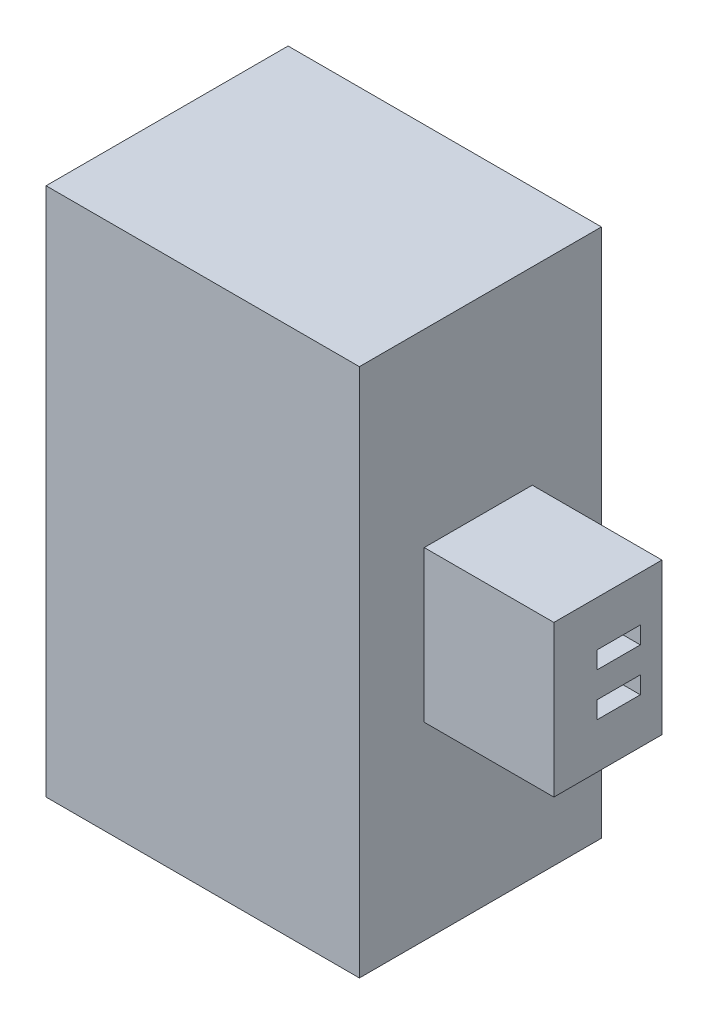
ISO-10303-21;
HEADER;
FILE_DESCRIPTION(('STEP AP214'),'2;1');
FILE_NAME('part.step','',(''),(''),'','','');
FILE_SCHEMA(('AUTOMOTIVE_DESIGN { 1 0 10303 214 1 1 1 1 }'));
ENDSEC;
DATA;
#1=APPLICATION_CONTEXT('core data for automotive mechanical design processes');
#2=APPLICATION_PROTOCOL_DEFINITION('international standard','automotive_design',2000,#1);
#3=PRODUCT_CONTEXT('',#1,'mechanical');
#4=PRODUCT('Part','Part','',(#3));
#5=PRODUCT_RELATED_PRODUCT_CATEGORY('part','',(#4));
#6=PRODUCT_DEFINITION_FORMATION('','',#4);
#7=PRODUCT_DEFINITION_CONTEXT('part definition',#1,'design');
#8=PRODUCT_DEFINITION('design','',#6,#7);
#9=PRODUCT_DEFINITION_SHAPE('','',#8);
#10=(LENGTH_UNIT() NAMED_UNIT(*) SI_UNIT(.MILLI.,.METRE.));
#11=(NAMED_UNIT(*) PLANE_ANGLE_UNIT() SI_UNIT($,.RADIAN.));
#12=(NAMED_UNIT(*) SI_UNIT($,.STERADIAN.) SOLID_ANGLE_UNIT());
#13=UNCERTAINTY_MEASURE_WITH_UNIT(LENGTH_MEASURE(1.E-05),#10,'distance_accuracy_value','');
#14=(GEOMETRIC_REPRESENTATION_CONTEXT(3) GLOBAL_UNCERTAINTY_ASSIGNED_CONTEXT((#13)) GLOBAL_UNIT_ASSIGNED_CONTEXT((#10,
#11,#12)) REPRESENTATION_CONTEXT('',''));
#15=CARTESIAN_POINT('',(0.,0.,0.));
#16=DIRECTION('',(0.,0.,1.));
#17=DIRECTION('',(1.,0.,0.));
#18=AXIS2_PLACEMENT_3D('',#15,#16,#17);
#19=CARTESIAN_POINT('',(0.,0.,5.6));
#20=DIRECTION('',(1.,0.,0.));
#21=DIRECTION('',(0.,0.,-1.));
#22=AXIS2_PLACEMENT_3D('',#19,#20,#21);
#23=PLANE('',#22);
#24=DIRECTION('',(0.,1.,0.));
#25=VECTOR('',#24,1.);
#26=CARTESIAN_POINT('',(0.,-1.62170824512628,4.85));
#27=LINE('',#26,#25);
#28=CARTESIAN_POINT('',(0.,0.750000000000001,4.85));
#29=VERTEX_POINT('',#28);
#30=CARTESIAN_POINT('',(0.,11.5,4.85));
#31=VERTEX_POINT('',#30);
#32=EDGE_CURVE('E171',#29,#31,#27,.T.);
#33=ORIENTED_EDGE('',*,*,#32,.T.);
#34=DIRECTION('',(0.,0.,1.));
#35=VECTOR('',#34,1.);
#36=CARTESIAN_POINT('',(0.,11.5,5.6));
#37=LINE('',#36,#35);
#38=CARTESIAN_POINT('',(0.,11.5,0.));
#39=VERTEX_POINT('',#38);
#40=EDGE_CURVE('E196',#39,#31,#37,.T.);
#41=ORIENTED_EDGE('',*,*,#40,.F.);
#42=DIRECTION('',(0.,-1.,0.));
#43=VECTOR('',#42,1.);
#44=CARTESIAN_POINT('',(0.,0.,0.));
#45=LINE('',#44,#43);
#46=CARTESIAN_POINT('',(0.,0.750000000000001,0.));
#47=VERTEX_POINT('',#46);
#48=EDGE_CURVE('E184',#39,#47,#45,.T.);
#49=ORIENTED_EDGE('',*,*,#48,.T.);
#50=DIRECTION('',(0.,0.,-1.));
#51=VECTOR('',#50,1.);
#52=CARTESIAN_POINT('',(0.,0.750000000000001,5.6));
#53=LINE('',#52,#51);
#54=EDGE_CURVE('E56',#29,#47,#53,.T.);
#55=ORIENTED_EDGE('',*,*,#54,.F.);
#56=EDGE_LOOP('',(#33,#41,#49,#55));
#57=FACE_BOUND('',#56,.T.);
#58=ADVANCED_FACE('F32',(#57),#23,.F.);
#59=CARTESIAN_POINT('',(-2.25,11.5,5.6));
#60=DIRECTION('',(0.,1.,0.));
#61=DIRECTION('',(0.,0.,1.));
#62=AXIS2_PLACEMENT_3D('',#59,#60,#61);
#63=PLANE('',#62);
#64=DIRECTION('',(1.,0.,0.));
#65=VECTOR('',#64,1.);
#66=CARTESIAN_POINT('',(-2.25,11.5,4.85));
#67=LINE('',#66,#65);
#68=CARTESIAN_POINT('',(-2.25,11.5,4.85));
#69=VERTEX_POINT('',#68);
#70=EDGE_CURVE('E176',#69,#31,#67,.T.);
#71=ORIENTED_EDGE('',*,*,#70,.F.);
#72=DIRECTION('',(0.,0.,1.));
#73=VECTOR('',#72,1.);
#74=CARTESIAN_POINT('',(-2.25,11.5,5.6));
#75=LINE('',#74,#73);
#76=CARTESIAN_POINT('',(-2.25,11.5,0.));
#77=VERTEX_POINT('',#76);
#78=EDGE_CURVE('E205',#77,#69,#75,.T.);
#79=ORIENTED_EDGE('',*,*,#78,.F.);
#80=DIRECTION('',(1.,0.,0.));
#81=VECTOR('',#80,1.);
#82=CARTESIAN_POINT('',(-2.25,11.5,0.));
#83=LINE('',#82,#81);
#84=EDGE_CURVE('E207',#77,#39,#83,.T.);
#85=ORIENTED_EDGE('',*,*,#84,.T.);
#86=ORIENTED_EDGE('',*,*,#40,.T.);
#87=EDGE_LOOP('',(#71,#79,#85,#86));
#88=FACE_BOUND('',#87,.T.);
#89=ADVANCED_FACE('F377',(#88),#63,.F.);
#90=CARTESIAN_POINT('',(-2.25,0.750000000000001,5.6));
#91=DIRECTION('',(0.,-1.,0.));
#92=DIRECTION('',(0.,0.,-1.));
#93=AXIS2_PLACEMENT_3D('',#90,#91,#92);
#94=PLANE('',#93);
#95=DIRECTION('',(1.,0.,0.));
#96=VECTOR('',#95,1.);
#97=CARTESIAN_POINT('',(-2.25,0.750000000000001,4.85));
#98=LINE('',#97,#96);
#99=CARTESIAN_POINT('',(-2.25,0.750000000000001,4.85));
#100=VERTEX_POINT('',#99);
#101=EDGE_CURVE('E173',#100,#29,#98,.T.);
#102=ORIENTED_EDGE('',*,*,#101,.T.);
#103=ORIENTED_EDGE('',*,*,#54,.T.);
#104=DIRECTION('',(1.,0.,0.));
#105=VECTOR('',#104,1.);
#106=CARTESIAN_POINT('',(-2.25,0.750000000000001,0.));
#107=LINE('',#106,#105);
#108=CARTESIAN_POINT('',(-2.25,0.750000000000001,0.));
#109=VERTEX_POINT('',#108);
#110=EDGE_CURVE('E194',#109,#47,#107,.T.);
#111=ORIENTED_EDGE('',*,*,#110,.F.);
#112=DIRECTION('',(0.,0.,-1.));
#113=VECTOR('',#112,1.);
#114=CARTESIAN_POINT('',(-2.25,0.750000000000001,5.6));
#115=LINE('',#114,#113);
#116=EDGE_CURVE('E181',#100,#109,#115,.T.);
#117=ORIENTED_EDGE('',*,*,#116,.F.);
#118=EDGE_LOOP('',(#102,#103,#111,#117));
#119=FACE_BOUND('',#118,.T.);
#120=ADVANCED_FACE('F180',(#119),#94,.F.);
#121=CARTESIAN_POINT('',(5.,0.,5.6));
#122=DIRECTION('',(-1.,0.,0.));
#123=DIRECTION('',(0.,0.,1.));
#124=AXIS2_PLACEMENT_3D('',#121,#122,#123);
#125=PLANE('',#124);
#126=DIRECTION('',(0.,1.,0.));
#127=VECTOR('',#126,1.);
#128=CARTESIAN_POINT('',(5.,0.,0.));
#129=LINE('',#128,#127);
#130=CARTESIAN_POINT('',(5.,0.,0.));
#131=VERTEX_POINT('',#130);
#132=CARTESIAN_POINT('',(5.,12.25,0.));
#133=VERTEX_POINT('',#132);
#134=EDGE_CURVE('E319',#131,#133,#129,.T.);
#135=ORIENTED_EDGE('',*,*,#134,.T.);
#136=DIRECTION('',(0.,0.,-1.));
#137=VECTOR('',#136,1.);
#138=CARTESIAN_POINT('',(5.,12.25,5.6));
#139=LINE('',#138,#137);
#140=CARTESIAN_POINT('',(5.,12.25,5.6));
#141=VERTEX_POINT('',#140);
#142=EDGE_CURVE('E40',#141,#133,#139,.T.);
#143=ORIENTED_EDGE('',*,*,#142,.F.);
#144=DIRECTION('',(0.,1.,0.));
#145=VECTOR('',#144,1.);
#146=CARTESIAN_POINT('',(5.,0.,5.6));
#147=LINE('',#146,#145);
#148=CARTESIAN_POINT('',(5.,0.,5.6));
#149=VERTEX_POINT('',#148);
#150=EDGE_CURVE('E311',#149,#141,#147,.T.);
#151=ORIENTED_EDGE('',*,*,#150,.F.);
#152=DIRECTION('',(0.,0.,-1.));
#153=VECTOR('',#152,1.);
#154=CARTESIAN_POINT('',(5.,0.,5.6));
#155=LINE('',#154,#153);
#156=EDGE_CURVE('E11',#149,#131,#155,.T.);
#157=ORIENTED_EDGE('',*,*,#156,.T.);
#158=EDGE_LOOP('',(#135,#143,#151,#157));
#159=FACE_BOUND('',#158,.T.);
#160=DIRECTION('',(0.,-1.,0.));
#161=VECTOR('',#160,1.);
#162=CARTESIAN_POINT('',(5.,7.875,4.1));
#163=LINE('',#162,#161);
#164=CARTESIAN_POINT('',(5.,7.875,4.1));
#165=VERTEX_POINT('',#164);
#166=CARTESIAN_POINT('',(5.,4.375,4.1));
#167=VERTEX_POINT('',#166);
#168=EDGE_CURVE('E276',#165,#167,#163,.T.);
#169=ORIENTED_EDGE('',*,*,#168,.F.);
#170=DIRECTION('',(0.,0.,1.));
#171=VECTOR('',#170,1.);
#172=CARTESIAN_POINT('',(5.,7.875,4.1));
#173=LINE('',#172,#171);
#174=CARTESIAN_POINT('',(5.,7.875,1.6));
#175=VERTEX_POINT('',#174);
#176=EDGE_CURVE('E281',#175,#165,#173,.T.);
#177=ORIENTED_EDGE('',*,*,#176,.F.);
#178=DIRECTION('',(0.,1.,0.));
#179=VECTOR('',#178,1.);
#180=CARTESIAN_POINT('',(5.,7.875,1.6));
#181=LINE('',#180,#179);
#182=CARTESIAN_POINT('',(5.,4.375,1.6));
#183=VERTEX_POINT('',#182);
#184=EDGE_CURVE('E293',#183,#175,#181,.T.);
#185=ORIENTED_EDGE('',*,*,#184,.F.);
#186=DIRECTION('',(0.,0.,-1.));
#187=VECTOR('',#186,1.);
#188=CARTESIAN_POINT('',(5.,4.375,4.1));
#189=LINE('',#188,#187);
#190=EDGE_CURVE('E290',#167,#183,#189,.T.);
#191=ORIENTED_EDGE('',*,*,#190,.F.);
#192=EDGE_LOOP('',(#169,#177,#185,#191));
#193=FACE_BOUND('',#192,.T.);
#194=ADVANCED_FACE('F344',(#159,#193),#125,.F.);
#195=CARTESIAN_POINT('',(0.,0.,5.6));
#196=DIRECTION('',(0.,1.,0.));
#197=DIRECTION('',(0.,0.,1.));
#198=AXIS2_PLACEMENT_3D('',#195,#196,#197);
#199=PLANE('',#198);
#200=DIRECTION('',(1.,0.,0.));
#201=VECTOR('',#200,1.);
#202=CARTESIAN_POINT('',(0.,0.,0.));
#203=LINE('',#202,#201);
#204=CARTESIAN_POINT('',(-2.25,0.,0.));
#205=VERTEX_POINT('',#204);
#206=EDGE_CURVE('E317',#205,#131,#203,.T.);
#207=ORIENTED_EDGE('',*,*,#206,.T.);
#208=ORIENTED_EDGE('',*,*,#156,.F.);
#209=DIRECTION('',(1.,0.,0.));
#210=VECTOR('',#209,1.);
#211=CARTESIAN_POINT('',(0.,0.,5.6));
#212=LINE('',#211,#210);
#213=CARTESIAN_POINT('',(-2.25,0.,5.6));
#214=VERTEX_POINT('',#213);
#215=EDGE_CURVE('E309',#214,#149,#212,.T.);
#216=ORIENTED_EDGE('',*,*,#215,.F.);
#217=DIRECTION('',(0.,0.,1.));
#218=VECTOR('',#217,1.);
#219=CARTESIAN_POINT('',(-2.25,0.,5.6));
#220=LINE('',#219,#218);
#221=EDGE_CURVE('E186',#205,#214,#220,.T.);
#222=ORIENTED_EDGE('',*,*,#221,.F.);
#223=EDGE_LOOP('',(#207,#208,#216,#222));
#224=FACE_BOUND('',#223,.T.);
#225=ADVANCED_FACE('F343',(#224),#199,.F.);
#226=CARTESIAN_POINT('',(0.,12.25,5.6));
#227=DIRECTION('',(0.,-1.,0.));
#228=DIRECTION('',(0.,0.,-1.));
#229=AXIS2_PLACEMENT_3D('',#226,#227,#228);
#230=PLANE('',#229);
#231=DIRECTION('',(-1.,0.,0.));
#232=VECTOR('',#231,1.);
#233=CARTESIAN_POINT('',(0.,12.25,0.));
#234=LINE('',#233,#232);
#235=CARTESIAN_POINT('',(-2.25,12.25,0.));
#236=VERTEX_POINT('',#235);
#237=EDGE_CURVE('E312',#133,#236,#234,.T.);
#238=ORIENTED_EDGE('',*,*,#237,.T.);
#239=DIRECTION('',(0.,0.,-1.));
#240=VECTOR('',#239,1.);
#241=CARTESIAN_POINT('',(-2.25,12.25,5.6));
#242=LINE('',#241,#240);
#243=CARTESIAN_POINT('',(-2.25,12.25,5.6));
#244=VERTEX_POINT('',#243);
#245=EDGE_CURVE('E200',#244,#236,#242,.T.);
#246=ORIENTED_EDGE('',*,*,#245,.F.);
#247=DIRECTION('',(-1.,0.,0.));
#248=VECTOR('',#247,1.);
#249=CARTESIAN_POINT('',(0.,12.25,5.6));
#250=LINE('',#249,#248);
#251=EDGE_CURVE('E314',#141,#244,#250,.T.);
#252=ORIENTED_EDGE('',*,*,#251,.F.);
#253=ORIENTED_EDGE('',*,*,#142,.T.);
#254=EDGE_LOOP('',(#238,#246,#252,#253));
#255=FACE_BOUND('',#254,.T.);
#256=ADVANCED_FACE('F327',(#255),#230,.F.);
#257=CARTESIAN_POINT('',(0.,0.,5.6));
#258=DIRECTION('',(0.,0.,-1.));
#259=DIRECTION('',(-1.,0.,0.));
#260=AXIS2_PLACEMENT_3D('',#257,#258,#259);
#261=PLANE('',#260);
#262=ORIENTED_EDGE('',*,*,#251,.T.);
#263=DIRECTION('',(0.,1.,0.));
#264=VECTOR('',#263,1.);
#265=CARTESIAN_POINT('',(-2.25,12.25,5.6));
#266=LINE('',#265,#264);
#267=EDGE_CURVE('E197',#214,#244,#266,.T.);
#268=ORIENTED_EDGE('',*,*,#267,.F.);
#269=ORIENTED_EDGE('',*,*,#215,.T.);
#270=ORIENTED_EDGE('',*,*,#150,.T.);
#271=EDGE_LOOP('',(#262,#268,#269,#270));
#272=FACE_BOUND('',#271,.T.);
#273=ADVANCED_FACE('F340',(#272),#261,.F.);
#274=CARTESIAN_POINT('',(0.,0.,0.));
#275=DIRECTION('',(0.,0.,-1.));
#276=DIRECTION('',(-1.,0.,0.));
#277=AXIS2_PLACEMENT_3D('',#274,#275,#276);
#278=PLANE('',#277);
#279=ORIENTED_EDGE('',*,*,#48,.F.);
#280=ORIENTED_EDGE('',*,*,#84,.F.);
#281=DIRECTION('',(0.,-1.,0.));
#282=VECTOR('',#281,1.);
#283=CARTESIAN_POINT('',(-2.25,12.25,0.));
#284=LINE('',#283,#282);
#285=EDGE_CURVE('E203',#236,#77,#284,.T.);
#286=ORIENTED_EDGE('',*,*,#285,.F.);
#287=ORIENTED_EDGE('',*,*,#237,.F.);
#288=ORIENTED_EDGE('',*,*,#134,.F.);
#289=ORIENTED_EDGE('',*,*,#206,.F.);
#290=DIRECTION('',(0.,-1.,0.));
#291=VECTOR('',#290,1.);
#292=CARTESIAN_POINT('',(-2.25,0.,0.));
#293=LINE('',#292,#291);
#294=EDGE_CURVE('E192',#109,#205,#293,.T.);
#295=ORIENTED_EDGE('',*,*,#294,.F.);
#296=ORIENTED_EDGE('',*,*,#110,.T.);
#297=EDGE_LOOP('',(#279,#280,#286,#287,#288,#289,#295,#296));
#298=FACE_BOUND('',#297,.T.);
#299=ADVANCED_FACE('F334',(#298),#278,.T.);
#300=CARTESIAN_POINT('',(8.,0.,0.));
#301=DIRECTION('',(1.,0.,0.));
#302=DIRECTION('',(0.,0.,-1.));
#303=AXIS2_PLACEMENT_3D('',#300,#301,#302);
#304=PLANE('',#303);
#305=DIRECTION('',(0.,0.,-1.));
#306=VECTOR('',#305,1.);
#307=CARTESIAN_POINT('',(8.,6.425,3.1));
#308=LINE('',#307,#306);
#309=CARTESIAN_POINT('',(8.,6.425,3.1));
#310=VERTEX_POINT('',#309);
#311=CARTESIAN_POINT('',(8.,6.425,2.1));
#312=VERTEX_POINT('',#311);
#313=EDGE_CURVE('E249',#310,#312,#308,.T.);
#314=ORIENTED_EDGE('',*,*,#313,.F.);
#315=DIRECTION('',(0.,-1.,0.));
#316=VECTOR('',#315,1.);
#317=CARTESIAN_POINT('',(8.,6.825,3.1));
#318=LINE('',#317,#316);
#319=CARTESIAN_POINT('',(8.,6.825,3.1));
#320=VERTEX_POINT('',#319);
#321=EDGE_CURVE('E247',#320,#310,#318,.T.);
#322=ORIENTED_EDGE('',*,*,#321,.F.);
#323=DIRECTION('',(0.,0.,1.));
#324=VECTOR('',#323,1.);
#325=CARTESIAN_POINT('',(8.,6.825,3.1));
#326=LINE('',#325,#324);
#327=CARTESIAN_POINT('',(8.,6.825,2.1));
#328=VERTEX_POINT('',#327);
#329=EDGE_CURVE('E255',#328,#320,#326,.T.);
#330=ORIENTED_EDGE('',*,*,#329,.F.);
#331=DIRECTION('',(0.,1.,0.));
#332=VECTOR('',#331,1.);
#333=CARTESIAN_POINT('',(8.,6.825,2.1));
#334=LINE('',#333,#332);
#335=EDGE_CURVE('E252',#312,#328,#334,.T.);
#336=ORIENTED_EDGE('',*,*,#335,.F.);
#337=EDGE_LOOP('',(#314,#322,#330,#336));
#338=FACE_BOUND('',#337,.T.);
#339=DIRECTION('',(0.,-1.,0.));
#340=VECTOR('',#339,1.);
#341=CARTESIAN_POINT('',(8.,7.875,4.1));
#342=LINE('',#341,#340);
#343=CARTESIAN_POINT('',(8.,7.875,4.1));
#344=VERTEX_POINT('',#343);
#345=CARTESIAN_POINT('',(8.,4.375,4.1));
#346=VERTEX_POINT('',#345);
#347=EDGE_CURVE('E277',#344,#346,#342,.T.);
#348=ORIENTED_EDGE('',*,*,#347,.T.);
#349=DIRECTION('',(0.,0.,-1.));
#350=VECTOR('',#349,1.);
#351=CARTESIAN_POINT('',(8.,4.375,4.1));
#352=LINE('',#351,#350);
#353=CARTESIAN_POINT('',(8.,4.375,1.6));
#354=VERTEX_POINT('',#353);
#355=EDGE_CURVE('E280',#346,#354,#352,.T.);
#356=ORIENTED_EDGE('',*,*,#355,.T.);
#357=DIRECTION('',(0.,1.,0.));
#358=VECTOR('',#357,1.);
#359=CARTESIAN_POINT('',(8.,7.875,1.6));
#360=LINE('',#359,#358);
#361=CARTESIAN_POINT('',(8.,7.875,1.6));
#362=VERTEX_POINT('',#361);
#363=EDGE_CURVE('E283',#354,#362,#360,.T.);
#364=ORIENTED_EDGE('',*,*,#363,.T.);
#365=DIRECTION('',(0.,0.,1.));
#366=VECTOR('',#365,1.);
#367=CARTESIAN_POINT('',(8.,7.875,4.1));
#368=LINE('',#367,#366);
#369=EDGE_CURVE('E285',#362,#344,#368,.T.);
#370=ORIENTED_EDGE('',*,*,#369,.T.);
#371=EDGE_LOOP('',(#348,#356,#364,#370));
#372=FACE_BOUND('',#371,.T.);
#373=DIRECTION('',(0.,0.,-1.));
#374=VECTOR('',#373,1.);
#375=CARTESIAN_POINT('',(8.,5.425,3.1));
#376=LINE('',#375,#374);
#377=CARTESIAN_POINT('',(8.,5.425,3.1));
#378=VERTEX_POINT('',#377);
#379=CARTESIAN_POINT('',(8.,5.425,2.1));
#380=VERTEX_POINT('',#379);
#381=EDGE_CURVE('E616',#378,#380,#376,.T.);
#382=ORIENTED_EDGE('',*,*,#381,.F.);
#383=DIRECTION('',(0.,-1.,0.));
#384=VECTOR('',#383,1.);
#385=CARTESIAN_POINT('',(8.,5.425,3.1));
#386=LINE('',#385,#384);
#387=CARTESIAN_POINT('',(8.,5.825,3.1));
#388=VERTEX_POINT('',#387);
#389=EDGE_CURVE('E210',#388,#378,#386,.T.);
#390=ORIENTED_EDGE('',*,*,#389,.F.);
#391=DIRECTION('',(0.,0.,1.));
#392=VECTOR('',#391,1.);
#393=CARTESIAN_POINT('',(8.,5.825,3.1));
#394=LINE('',#393,#392);
#395=CARTESIAN_POINT('',(8.,5.825,2.1));
#396=VERTEX_POINT('',#395);
#397=EDGE_CURVE('E230',#396,#388,#394,.T.);
#398=ORIENTED_EDGE('',*,*,#397,.F.);
#399=DIRECTION('',(0.,1.,0.));
#400=VECTOR('',#399,1.);
#401=CARTESIAN_POINT('',(8.,5.425,2.1));
#402=LINE('',#401,#400);
#403=EDGE_CURVE('E619',#380,#396,#402,.T.);
#404=ORIENTED_EDGE('',*,*,#403,.F.);
#405=EDGE_LOOP('',(#382,#390,#398,#404));
#406=FACE_BOUND('',#405,.T.);
#407=ADVANCED_FACE('F360',(#338,#372,#406),#304,.T.);
#408=CARTESIAN_POINT('',(8.,7.875,4.1));
#409=DIRECTION('',(0.,0.,-1.));
#410=DIRECTION('',(-1.,0.,0.));
#411=AXIS2_PLACEMENT_3D('',#408,#409,#410);
#412=PLANE('',#411);
#413=ORIENTED_EDGE('',*,*,#168,.T.);
#414=DIRECTION('',(-1.,0.,0.));
#415=VECTOR('',#414,1.);
#416=CARTESIAN_POINT('',(8.,4.375,4.1));
#417=LINE('',#416,#415);
#418=EDGE_CURVE('E306',#346,#167,#417,.T.);
#419=ORIENTED_EDGE('',*,*,#418,.F.);
#420=ORIENTED_EDGE('',*,*,#347,.F.);
#421=DIRECTION('',(-1.,0.,0.));
#422=VECTOR('',#421,1.);
#423=CARTESIAN_POINT('',(8.,7.875,4.1));
#424=LINE('',#423,#422);
#425=EDGE_CURVE('E287',#344,#165,#424,.T.);
#426=ORIENTED_EDGE('',*,*,#425,.T.);
#427=EDGE_LOOP('',(#413,#419,#420,#426));
#428=FACE_BOUND('',#427,.T.);
#429=ADVANCED_FACE('F358',(#428),#412,.F.);
#430=CARTESIAN_POINT('',(8.,4.375,4.1));
#431=DIRECTION('',(0.,1.,0.));
#432=DIRECTION('',(0.,0.,1.));
#433=AXIS2_PLACEMENT_3D('',#430,#431,#432);
#434=PLANE('',#433);
#435=ORIENTED_EDGE('',*,*,#190,.T.);
#436=DIRECTION('',(-1.,0.,0.));
#437=VECTOR('',#436,1.);
#438=CARTESIAN_POINT('',(8.,4.375,1.6));
#439=LINE('',#438,#437);
#440=EDGE_CURVE('E303',#354,#183,#439,.T.);
#441=ORIENTED_EDGE('',*,*,#440,.F.);
#442=ORIENTED_EDGE('',*,*,#355,.F.);
#443=ORIENTED_EDGE('',*,*,#418,.T.);
#444=EDGE_LOOP('',(#435,#441,#442,#443));
#445=FACE_BOUND('',#444,.T.);
#446=ADVANCED_FACE('F367',(#445),#434,.F.);
#447=CARTESIAN_POINT('',(8.,7.875,1.6));
#448=DIRECTION('',(0.,0.,1.));
#449=DIRECTION('',(1.,0.,0.));
#450=AXIS2_PLACEMENT_3D('',#447,#448,#449);
#451=PLANE('',#450);
#452=ORIENTED_EDGE('',*,*,#184,.T.);
#453=DIRECTION('',(-1.,0.,0.));
#454=VECTOR('',#453,1.);
#455=CARTESIAN_POINT('',(8.,7.875,1.6));
#456=LINE('',#455,#454);
#457=EDGE_CURVE('E300',#362,#175,#456,.T.);
#458=ORIENTED_EDGE('',*,*,#457,.F.);
#459=ORIENTED_EDGE('',*,*,#363,.F.);
#460=ORIENTED_EDGE('',*,*,#440,.T.);
#461=EDGE_LOOP('',(#452,#458,#459,#460));
#462=FACE_BOUND('',#461,.T.);
#463=ADVANCED_FACE('F365',(#462),#451,.F.);
#464=CARTESIAN_POINT('',(8.,7.875,4.1));
#465=DIRECTION('',(0.,-1.,0.));
#466=DIRECTION('',(0.,0.,-1.));
#467=AXIS2_PLACEMENT_3D('',#464,#465,#466);
#468=PLANE('',#467);
#469=ORIENTED_EDGE('',*,*,#176,.T.);
#470=ORIENTED_EDGE('',*,*,#425,.F.);
#471=ORIENTED_EDGE('',*,*,#369,.F.);
#472=ORIENTED_EDGE('',*,*,#457,.T.);
#473=EDGE_LOOP('',(#469,#470,#471,#472));
#474=FACE_BOUND('',#473,.T.);
#475=ADVANCED_FACE('F354',(#474),#468,.F.);
#476=CARTESIAN_POINT('',(8.,6.825,3.1));
#477=DIRECTION('',(0.,0.,-1.));
#478=DIRECTION('',(-1.,0.,0.));
#479=AXIS2_PLACEMENT_3D('',#476,#477,#478);
#480=PLANE('',#479);
#481=DIRECTION('',(0.,-1.,0.));
#482=VECTOR('',#481,1.);
#483=CARTESIAN_POINT('',(5.,6.825,3.1));
#484=LINE('',#483,#482);
#485=CARTESIAN_POINT('',(5.,6.825,3.1));
#486=VERTEX_POINT('',#485);
#487=CARTESIAN_POINT('',(5.,6.425,3.1));
#488=VERTEX_POINT('',#487);
#489=EDGE_CURVE('E246',#486,#488,#484,.T.);
#490=ORIENTED_EDGE('',*,*,#489,.F.);
#491=DIRECTION('',(-1.,0.,0.));
#492=VECTOR('',#491,1.);
#493=CARTESIAN_POINT('',(8.,6.825,3.1));
#494=LINE('',#493,#492);
#495=EDGE_CURVE('E257',#320,#486,#494,.T.);
#496=ORIENTED_EDGE('',*,*,#495,.F.);
#497=ORIENTED_EDGE('',*,*,#321,.T.);
#498=DIRECTION('',(-1.,0.,0.));
#499=VECTOR('',#498,1.);
#500=CARTESIAN_POINT('',(8.,6.425,3.1));
#501=LINE('',#500,#499);
#502=EDGE_CURVE('E273',#310,#488,#501,.T.);
#503=ORIENTED_EDGE('',*,*,#502,.T.);
#504=EDGE_LOOP('',(#490,#496,#497,#503));
#505=FACE_BOUND('',#504,.T.);
#506=ADVANCED_FACE('F415',(#505),#480,.T.);
#507=CARTESIAN_POINT('',(8.,6.425,3.1));
#508=DIRECTION('',(0.,1.,0.));
#509=DIRECTION('',(0.,0.,1.));
#510=AXIS2_PLACEMENT_3D('',#507,#508,#509);
#511=PLANE('',#510);
#512=DIRECTION('',(0.,0.,-1.));
#513=VECTOR('',#512,1.);
#514=CARTESIAN_POINT('',(5.,6.425,3.1));
#515=LINE('',#514,#513);
#516=CARTESIAN_POINT('',(5.,6.425,2.1));
#517=VERTEX_POINT('',#516);
#518=EDGE_CURVE('E260',#488,#517,#515,.T.);
#519=ORIENTED_EDGE('',*,*,#518,.F.);
#520=ORIENTED_EDGE('',*,*,#502,.F.);
#521=ORIENTED_EDGE('',*,*,#313,.T.);
#522=DIRECTION('',(-1.,0.,0.));
#523=VECTOR('',#522,1.);
#524=CARTESIAN_POINT('',(8.,6.425,2.1));
#525=LINE('',#524,#523);
#526=EDGE_CURVE('E271',#312,#517,#525,.T.);
#527=ORIENTED_EDGE('',*,*,#526,.T.);
#528=EDGE_LOOP('',(#519,#520,#521,#527));
#529=FACE_BOUND('',#528,.T.);
#530=ADVANCED_FACE('F411',(#529),#511,.T.);
#531=CARTESIAN_POINT('',(8.,6.825,2.1));
#532=DIRECTION('',(0.,0.,1.));
#533=DIRECTION('',(1.,0.,0.));
#534=AXIS2_PLACEMENT_3D('',#531,#532,#533);
#535=PLANE('',#534);
#536=DIRECTION('',(0.,1.,0.));
#537=VECTOR('',#536,1.);
#538=CARTESIAN_POINT('',(5.,6.825,2.1));
#539=LINE('',#538,#537);
#540=CARTESIAN_POINT('',(5.,6.825,2.1));
#541=VERTEX_POINT('',#540);
#542=EDGE_CURVE('E263',#517,#541,#539,.T.);
#543=ORIENTED_EDGE('',*,*,#542,.F.);
#544=ORIENTED_EDGE('',*,*,#526,.F.);
#545=ORIENTED_EDGE('',*,*,#335,.T.);
#546=DIRECTION('',(-1.,0.,0.));
#547=VECTOR('',#546,1.);
#548=CARTESIAN_POINT('',(8.,6.825,2.1));
#549=LINE('',#548,#547);
#550=EDGE_CURVE('E269',#328,#541,#549,.T.);
#551=ORIENTED_EDGE('',*,*,#550,.T.);
#552=EDGE_LOOP('',(#543,#544,#545,#551));
#553=FACE_BOUND('',#552,.T.);
#554=ADVANCED_FACE('F407',(#553),#535,.T.);
#555=CARTESIAN_POINT('',(8.,6.825,3.1));
#556=DIRECTION('',(0.,-1.,0.));
#557=DIRECTION('',(0.,0.,-1.));
#558=AXIS2_PLACEMENT_3D('',#555,#556,#557);
#559=PLANE('',#558);
#560=DIRECTION('',(0.,0.,1.));
#561=VECTOR('',#560,1.);
#562=CARTESIAN_POINT('',(5.,6.825,3.1));
#563=LINE('',#562,#561);
#564=EDGE_CURVE('E250',#541,#486,#563,.T.);
#565=ORIENTED_EDGE('',*,*,#564,.F.);
#566=ORIENTED_EDGE('',*,*,#550,.F.);
#567=ORIENTED_EDGE('',*,*,#329,.T.);
#568=ORIENTED_EDGE('',*,*,#495,.T.);
#569=EDGE_LOOP('',(#565,#566,#567,#568));
#570=FACE_BOUND('',#569,.T.);
#571=ADVANCED_FACE('F403',(#570),#559,.T.);
#572=CARTESIAN_POINT('',(8.,5.425,3.1));
#573=DIRECTION('',(0.,0.,-1.));
#574=DIRECTION('',(-1.,0.,0.));
#575=AXIS2_PLACEMENT_3D('',#572,#573,#574);
#576=PLANE('',#575);
#577=DIRECTION('',(0.,-1.,0.));
#578=VECTOR('',#577,1.);
#579=CARTESIAN_POINT('',(5.,5.425,3.1));
#580=LINE('',#579,#578);
#581=CARTESIAN_POINT('',(5.,5.825,3.1));
#582=VERTEX_POINT('',#581);
#583=CARTESIAN_POINT('',(5.,5.425,3.1));
#584=VERTEX_POINT('',#583);
#585=EDGE_CURVE('E216',#582,#584,#580,.T.);
#586=ORIENTED_EDGE('',*,*,#585,.F.);
#587=DIRECTION('',(-1.,0.,0.));
#588=VECTOR('',#587,1.);
#589=CARTESIAN_POINT('',(8.,5.825,3.1));
#590=LINE('',#589,#588);
#591=EDGE_CURVE('E237',#388,#582,#590,.T.);
#592=ORIENTED_EDGE('',*,*,#591,.F.);
#593=ORIENTED_EDGE('',*,*,#389,.T.);
#594=DIRECTION('',(-1.,0.,0.));
#595=VECTOR('',#594,1.);
#596=CARTESIAN_POINT('',(8.,5.425,3.1));
#597=LINE('',#596,#595);
#598=EDGE_CURVE('E243',#378,#584,#597,.T.);
#599=ORIENTED_EDGE('',*,*,#598,.T.);
#600=EDGE_LOOP('',(#586,#592,#593,#599));
#601=FACE_BOUND('',#600,.T.);
#602=ADVANCED_FACE('F399',(#601),#576,.T.);
#603=CARTESIAN_POINT('',(8.,5.425,3.1));
#604=DIRECTION('',(0.,1.,0.));
#605=DIRECTION('',(0.,0.,1.));
#606=AXIS2_PLACEMENT_3D('',#603,#604,#605);
#607=PLANE('',#606);
#608=DIRECTION('',(0.,0.,-1.));
#609=VECTOR('',#608,1.);
#610=CARTESIAN_POINT('',(5.,5.425,3.1));
#611=LINE('',#610,#609);
#612=CARTESIAN_POINT('',(5.,5.425,2.1));
#613=VERTEX_POINT('',#612);
#614=EDGE_CURVE('E221',#584,#613,#611,.T.);
#615=ORIENTED_EDGE('',*,*,#614,.F.);
#616=ORIENTED_EDGE('',*,*,#598,.F.);
#617=ORIENTED_EDGE('',*,*,#381,.T.);
#618=DIRECTION('',(-1.,0.,0.));
#619=VECTOR('',#618,1.);
#620=CARTESIAN_POINT('',(8.,5.425,2.1));
#621=LINE('',#620,#619);
#622=EDGE_CURVE('E241',#380,#613,#621,.T.);
#623=ORIENTED_EDGE('',*,*,#622,.T.);
#624=EDGE_LOOP('',(#615,#616,#617,#623));
#625=FACE_BOUND('',#624,.T.);
#626=ADVANCED_FACE('F395',(#625),#607,.T.);
#627=CARTESIAN_POINT('',(8.,5.425,2.1));
#628=DIRECTION('',(0.,0.,1.));
#629=DIRECTION('',(1.,0.,0.));
#630=AXIS2_PLACEMENT_3D('',#627,#628,#629);
#631=PLANE('',#630);
#632=DIRECTION('',(0.,1.,0.));
#633=VECTOR('',#632,1.);
#634=CARTESIAN_POINT('',(5.,5.425,2.1));
#635=LINE('',#634,#633);
#636=CARTESIAN_POINT('',(5.,5.825,2.1));
#637=VERTEX_POINT('',#636);
#638=EDGE_CURVE('E227',#613,#637,#635,.T.);
#639=ORIENTED_EDGE('',*,*,#638,.F.);
#640=ORIENTED_EDGE('',*,*,#622,.F.);
#641=ORIENTED_EDGE('',*,*,#403,.T.);
#642=DIRECTION('',(-1.,0.,0.));
#643=VECTOR('',#642,1.);
#644=CARTESIAN_POINT('',(8.,5.825,2.1));
#645=LINE('',#644,#643);
#646=EDGE_CURVE('E239',#396,#637,#645,.T.);
#647=ORIENTED_EDGE('',*,*,#646,.T.);
#648=EDGE_LOOP('',(#639,#640,#641,#647));
#649=FACE_BOUND('',#648,.T.);
#650=ADVANCED_FACE('F391',(#649),#631,.T.);
#651=CARTESIAN_POINT('',(8.,5.825,3.1));
#652=DIRECTION('',(0.,-1.,0.));
#653=DIRECTION('',(0.,0.,-1.));
#654=AXIS2_PLACEMENT_3D('',#651,#652,#653);
#655=PLANE('',#654);
#656=DIRECTION('',(0.,0.,1.));
#657=VECTOR('',#656,1.);
#658=CARTESIAN_POINT('',(5.,5.825,3.1));
#659=LINE('',#658,#657);
#660=EDGE_CURVE('E235',#637,#582,#659,.T.);
#661=ORIENTED_EDGE('',*,*,#660,.F.);
#662=ORIENTED_EDGE('',*,*,#646,.F.);
#663=ORIENTED_EDGE('',*,*,#397,.T.);
#664=ORIENTED_EDGE('',*,*,#591,.T.);
#665=EDGE_LOOP('',(#661,#662,#663,#664));
#666=FACE_BOUND('',#665,.T.);
#667=ADVANCED_FACE('F388',(#666),#655,.T.);
#668=ORIENTED_EDGE('',*,*,#564,.T.);
#669=ORIENTED_EDGE('',*,*,#489,.T.);
#670=ORIENTED_EDGE('',*,*,#518,.T.);
#671=ORIENTED_EDGE('',*,*,#542,.T.);
#672=EDGE_LOOP('',(#668,#669,#670,#671));
#673=FACE_BOUND('',#672,.T.);
#674=ADVANCED_FACE('F348',(#673),#125,.F.);
#675=ORIENTED_EDGE('',*,*,#660,.T.);
#676=ORIENTED_EDGE('',*,*,#585,.T.);
#677=ORIENTED_EDGE('',*,*,#614,.T.);
#678=ORIENTED_EDGE('',*,*,#638,.T.);
#679=EDGE_LOOP('',(#675,#676,#677,#678));
#680=FACE_BOUND('',#679,.T.);
#681=ADVANCED_FACE('F349',(#680),#125,.F.);
#682=CARTESIAN_POINT('',(-2.25,0.,0.));
#683=DIRECTION('',(1.,0.,0.));
#684=DIRECTION('',(0.,0.,-1.));
#685=AXIS2_PLACEMENT_3D('',#682,#683,#684);
#686=PLANE('',#685);
#687=ORIENTED_EDGE('',*,*,#267,.T.);
#688=ORIENTED_EDGE('',*,*,#245,.T.);
#689=ORIENTED_EDGE('',*,*,#285,.T.);
#690=ORIENTED_EDGE('',*,*,#78,.T.);
#691=DIRECTION('',(0.,1.,0.));
#692=VECTOR('',#691,1.);
#693=CARTESIAN_POINT('',(-2.25,-1.62170824512628,4.85));
#694=LINE('',#693,#692);
#695=EDGE_CURVE('E48',#100,#69,#694,.T.);
#696=ORIENTED_EDGE('',*,*,#695,.F.);
#697=ORIENTED_EDGE('',*,*,#116,.T.);
#698=ORIENTED_EDGE('',*,*,#294,.T.);
#699=ORIENTED_EDGE('',*,*,#221,.T.);
#700=EDGE_LOOP('',(#687,#688,#689,#690,#696,#697,#698,#699));
#701=FACE_BOUND('',#700,.T.);
#702=ADVANCED_FACE('F335',(#701),#686,.F.);
#703=CARTESIAN_POINT('',(-2.25,-1.62170824512628,4.85));
#704=DIRECTION('',(0.,0.,1.));
#705=DIRECTION('',(1.,0.,0.));
#706=AXIS2_PLACEMENT_3D('',#703,#704,#705);
#707=PLANE('',#706);
#708=ORIENTED_EDGE('',*,*,#101,.F.);
#709=ORIENTED_EDGE('',*,*,#695,.T.);
#710=ORIENTED_EDGE('',*,*,#70,.T.);
#711=ORIENTED_EDGE('',*,*,#32,.F.);
#712=EDGE_LOOP('',(#708,#709,#710,#711));
#713=FACE_BOUND('',#712,.T.);
#714=ADVANCED_FACE('F172',(#713),#707,.F.);
#715=CLOSED_SHELL('',(#58,#89,#120,#194,#225,#256,#273,#299,#407,#429,#446,#463,#475,#506,#530,
#554,#571,#602,#626,#650,#667,#674,#681,#702,#714));
#716=MANIFOLD_SOLID_BREP('B2',#715);
#717=ADVANCED_BREP_SHAPE_REPRESENTATION('',(#18,#716),#14);
#718=SHAPE_DEFINITION_REPRESENTATION(#9,#717);
ENDSEC;
END-ISO-10303-21;
